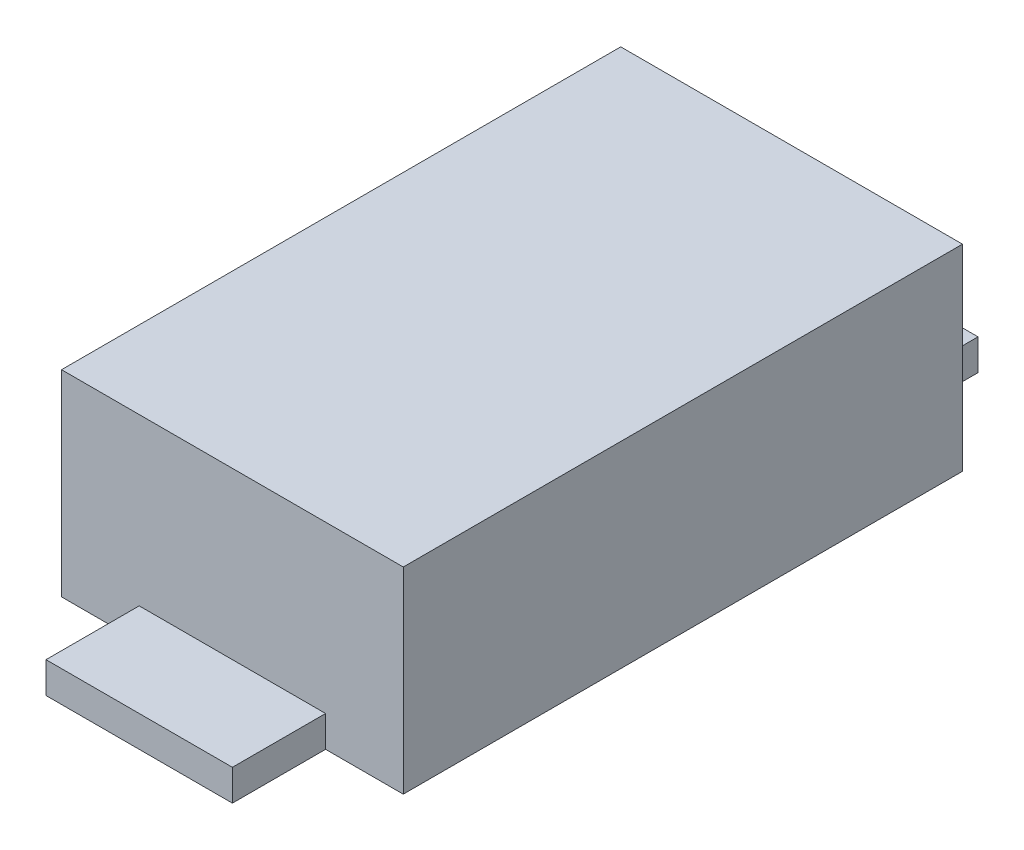
ISO-10303-21;
HEADER;
FILE_DESCRIPTION(('STEP AP214'),'2;1');
FILE_NAME('part.step','',(''),(''),'','','');
FILE_SCHEMA(('AUTOMOTIVE_DESIGN { 1 0 10303 214 1 1 1 1 }'));
ENDSEC;
DATA;
#1=APPLICATION_CONTEXT('core data for automotive mechanical design processes');
#2=APPLICATION_PROTOCOL_DEFINITION('international standard','automotive_design',2000,#1);
#3=PRODUCT_CONTEXT('',#1,'mechanical');
#4=PRODUCT('Part','Part','',(#3));
#5=PRODUCT_RELATED_PRODUCT_CATEGORY('part','',(#4));
#6=PRODUCT_DEFINITION_FORMATION('','',#4);
#7=PRODUCT_DEFINITION_CONTEXT('part definition',#1,'design');
#8=PRODUCT_DEFINITION('design','',#6,#7);
#9=PRODUCT_DEFINITION_SHAPE('','',#8);
#10=(LENGTH_UNIT() NAMED_UNIT(*) SI_UNIT(.MILLI.,.METRE.));
#11=(NAMED_UNIT(*) PLANE_ANGLE_UNIT() SI_UNIT($,.RADIAN.));
#12=(NAMED_UNIT(*) SI_UNIT($,.STERADIAN.) SOLID_ANGLE_UNIT());
#13=UNCERTAINTY_MEASURE_WITH_UNIT(LENGTH_MEASURE(1.E-05),#10,'distance_accuracy_value','');
#14=(GEOMETRIC_REPRESENTATION_CONTEXT(3) GLOBAL_UNCERTAINTY_ASSIGNED_CONTEXT((#13)) GLOBAL_UNIT_ASSIGNED_CONTEXT((#10,
#11,#12)) REPRESENTATION_CONTEXT('',''));
#15=CARTESIAN_POINT('',(0.,0.,0.));
#16=DIRECTION('',(0.,0.,1.));
#17=DIRECTION('',(1.,0.,0.));
#18=AXIS2_PLACEMENT_3D('',#15,#16,#17);
#19=CARTESIAN_POINT('',(-0.825,0.95,1.35));
#20=DIRECTION('',(0.,0.,-1.));
#21=DIRECTION('',(-1.,0.,0.));
#22=AXIS2_PLACEMENT_3D('',#19,#20,#21);
#23=PLANE('',#22);
#24=DIRECTION('',(0.,-1.,0.));
#25=VECTOR('',#24,1.);
#26=CARTESIAN_POINT('',(-0.45,0.15,1.35));
#27=LINE('',#26,#25);
#28=CARTESIAN_POINT('',(-0.45,0.15,1.35));
#29=VERTEX_POINT('',#28);
#30=CARTESIAN_POINT('',(-0.45,0.,1.35));
#31=VERTEX_POINT('',#30);
#32=EDGE_CURVE('E158',#29,#31,#27,.T.);
#33=ORIENTED_EDGE('',*,*,#32,.F.);
#34=DIRECTION('',(1.,0.,0.));
#35=VECTOR('',#34,1.);
#36=CARTESIAN_POINT('',(-0.45,0.15,1.35));
#37=LINE('',#36,#35);
#38=CARTESIAN_POINT('',(0.45,0.15,1.35));
#39=VERTEX_POINT('',#38);
#40=EDGE_CURVE('E149',#29,#39,#37,.T.);
#41=ORIENTED_EDGE('',*,*,#40,.T.);
#42=DIRECTION('',(0.,-1.,0.));
#43=VECTOR('',#42,1.);
#44=CARTESIAN_POINT('',(0.45,0.15,1.35));
#45=LINE('',#44,#43);
#46=CARTESIAN_POINT('',(0.45,0.,1.35));
#47=VERTEX_POINT('',#46);
#48=EDGE_CURVE('E164',#39,#47,#45,.T.);
#49=ORIENTED_EDGE('',*,*,#48,.T.);
#50=DIRECTION('',(1.,0.,0.));
#51=VECTOR('',#50,1.);
#52=CARTESIAN_POINT('',(-0.825,0.,1.35));
#53=LINE('',#52,#51);
#54=CARTESIAN_POINT('',(0.825,0.,1.35));
#55=VERTEX_POINT('',#54);
#56=EDGE_CURVE('E209',#47,#55,#53,.T.);
#57=ORIENTED_EDGE('',*,*,#56,.T.);
#58=DIRECTION('',(0.,-1.,0.));
#59=VECTOR('',#58,1.);
#60=CARTESIAN_POINT('',(0.825,0.95,1.35));
#61=LINE('',#60,#59);
#62=CARTESIAN_POINT('',(0.825,0.95,1.35));
#63=VERTEX_POINT('',#62);
#64=EDGE_CURVE('E200',#63,#55,#61,.T.);
#65=ORIENTED_EDGE('',*,*,#64,.F.);
#66=DIRECTION('',(1.,0.,0.));
#67=VECTOR('',#66,1.);
#68=CARTESIAN_POINT('',(-0.825,0.95,1.35));
#69=LINE('',#68,#67);
#70=CARTESIAN_POINT('',(-0.825,0.95,1.35));
#71=VERTEX_POINT('',#70);
#72=EDGE_CURVE('E198',#71,#63,#69,.T.);
#73=ORIENTED_EDGE('',*,*,#72,.F.);
#74=DIRECTION('',(0.,-1.,0.));
#75=VECTOR('',#74,1.);
#76=CARTESIAN_POINT('',(-0.825,0.95,1.35));
#77=LINE('',#76,#75);
#78=CARTESIAN_POINT('',(-0.825,0.,1.35));
#79=VERTEX_POINT('',#78);
#80=EDGE_CURVE('E214',#71,#79,#77,.T.);
#81=ORIENTED_EDGE('',*,*,#80,.T.);
#82=EDGE_CURVE('E194',#79,#31,#53,.T.);
#83=ORIENTED_EDGE('',*,*,#82,.T.);
#84=EDGE_LOOP('',(#33,#41,#49,#57,#65,#73,#81,#83));
#85=FACE_BOUND('',#84,.T.);
#86=ADVANCED_FACE('F39',(#85),#23,.F.);
#87=CARTESIAN_POINT('',(-0.825000000000001,0.95,-1.35));
#88=DIRECTION('',(0.,0.,1.));
#89=DIRECTION('',(1.,0.,0.));
#90=AXIS2_PLACEMENT_3D('',#87,#88,#89);
#91=PLANE('',#90);
#92=DIRECTION('',(0.,-1.,0.));
#93=VECTOR('',#92,1.);
#94=CARTESIAN_POINT('',(0.45,0.15,-1.35));
#95=LINE('',#94,#93);
#96=CARTESIAN_POINT('',(0.45,0.15,-1.35));
#97=VERTEX_POINT('',#96);
#98=CARTESIAN_POINT('',(0.45,0.,-1.35));
#99=VERTEX_POINT('',#98);
#100=EDGE_CURVE('E185',#97,#99,#95,.T.);
#101=ORIENTED_EDGE('',*,*,#100,.F.);
#102=DIRECTION('',(1.,0.,0.));
#103=VECTOR('',#102,1.);
#104=CARTESIAN_POINT('',(-0.45,0.15,-1.35));
#105=LINE('',#104,#103);
#106=CARTESIAN_POINT('',(-0.45,0.15,-1.35));
#107=VERTEX_POINT('',#106);
#108=EDGE_CURVE('E169',#107,#97,#105,.T.);
#109=ORIENTED_EDGE('',*,*,#108,.F.);
#110=DIRECTION('',(0.,-1.,0.));
#111=VECTOR('',#110,1.);
#112=CARTESIAN_POINT('',(-0.45,0.15,-1.35));
#113=LINE('',#112,#111);
#114=CARTESIAN_POINT('',(-0.45,0.,-1.35));
#115=VERTEX_POINT('',#114);
#116=EDGE_CURVE('E187',#107,#115,#113,.T.);
#117=ORIENTED_EDGE('',*,*,#116,.T.);
#118=DIRECTION('',(-1.,0.,0.));
#119=VECTOR('',#118,1.);
#120=CARTESIAN_POINT('',(-0.825000000000001,0.,-1.35));
#121=LINE('',#120,#119);
#122=CARTESIAN_POINT('',(-0.825000000000001,0.,-1.35));
#123=VERTEX_POINT('',#122);
#124=EDGE_CURVE('E203',#115,#123,#121,.T.);
#125=ORIENTED_EDGE('',*,*,#124,.T.);
#126=DIRECTION('',(0.,-1.,0.));
#127=VECTOR('',#126,1.);
#128=CARTESIAN_POINT('',(-0.825000000000001,0.95,-1.35));
#129=LINE('',#128,#127);
#130=CARTESIAN_POINT('',(-0.825000000000001,0.95,-1.35));
#131=VERTEX_POINT('',#130);
#132=EDGE_CURVE('E47',#131,#123,#129,.T.);
#133=ORIENTED_EDGE('',*,*,#132,.F.);
#134=DIRECTION('',(-1.,0.,0.));
#135=VECTOR('',#134,1.);
#136=CARTESIAN_POINT('',(-0.825000000000001,0.95,-1.35));
#137=LINE('',#136,#135);
#138=CARTESIAN_POINT('',(0.824999999999999,0.95,-1.35));
#139=VERTEX_POINT('',#138);
#140=EDGE_CURVE('E193',#139,#131,#137,.T.);
#141=ORIENTED_EDGE('',*,*,#140,.F.);
#142=DIRECTION('',(0.,-1.,0.));
#143=VECTOR('',#142,1.);
#144=CARTESIAN_POINT('',(0.824999999999999,0.95,-1.35));
#145=LINE('',#144,#143);
#146=CARTESIAN_POINT('',(0.824999999999999,0.,-1.35));
#147=VERTEX_POINT('',#146);
#148=EDGE_CURVE('E11',#139,#147,#145,.T.);
#149=ORIENTED_EDGE('',*,*,#148,.T.);
#150=EDGE_CURVE('E204',#147,#99,#121,.T.);
#151=ORIENTED_EDGE('',*,*,#150,.T.);
#152=EDGE_LOOP('',(#101,#109,#117,#125,#133,#141,#149,#151));
#153=FACE_BOUND('',#152,.T.);
#154=ADVANCED_FACE('F237',(#153),#91,.F.);
#155=CARTESIAN_POINT('',(0.824999999999999,0.95,-1.35));
#156=DIRECTION('',(-1.,0.,0.));
#157=DIRECTION('',(0.,0.,1.));
#158=AXIS2_PLACEMENT_3D('',#155,#156,#157);
#159=PLANE('',#158);
#160=DIRECTION('',(0.,0.,-1.));
#161=VECTOR('',#160,1.);
#162=CARTESIAN_POINT('',(0.824999999999999,0.,-1.35));
#163=LINE('',#162,#161);
#164=EDGE_CURVE('E189',#55,#147,#163,.T.);
#165=ORIENTED_EDGE('',*,*,#164,.T.);
#166=ORIENTED_EDGE('',*,*,#148,.F.);
#167=DIRECTION('',(0.,0.,-1.));
#168=VECTOR('',#167,1.);
#169=CARTESIAN_POINT('',(0.824999999999999,0.95,-1.35));
#170=LINE('',#169,#168);
#171=EDGE_CURVE('E190',#63,#139,#170,.T.);
#172=ORIENTED_EDGE('',*,*,#171,.F.);
#173=ORIENTED_EDGE('',*,*,#64,.T.);
#174=EDGE_LOOP('',(#165,#166,#172,#173));
#175=FACE_BOUND('',#174,.T.);
#176=ADVANCED_FACE('F41',(#175),#159,.F.);
#177=CARTESIAN_POINT('',(-0.825000000000001,0.95,-1.35));
#178=DIRECTION('',(1.,0.,0.));
#179=DIRECTION('',(0.,0.,-1.));
#180=AXIS2_PLACEMENT_3D('',#177,#178,#179);
#181=PLANE('',#180);
#182=DIRECTION('',(0.,0.,1.));
#183=VECTOR('',#182,1.);
#184=CARTESIAN_POINT('',(-0.825000000000001,0.,-1.35));
#185=LINE('',#184,#183);
#186=EDGE_CURVE('E207',#123,#79,#185,.T.);
#187=ORIENTED_EDGE('',*,*,#186,.T.);
#188=ORIENTED_EDGE('',*,*,#80,.F.);
#189=DIRECTION('',(0.,0.,1.));
#190=VECTOR('',#189,1.);
#191=CARTESIAN_POINT('',(-0.825000000000001,0.95,-1.35));
#192=LINE('',#191,#190);
#193=EDGE_CURVE('E196',#131,#71,#192,.T.);
#194=ORIENTED_EDGE('',*,*,#193,.F.);
#195=ORIENTED_EDGE('',*,*,#132,.T.);
#196=EDGE_LOOP('',(#187,#188,#194,#195));
#197=FACE_BOUND('',#196,.T.);
#198=ADVANCED_FACE('F221',(#197),#181,.F.);
#199=CARTESIAN_POINT('',(0.,0.95,0.));
#200=DIRECTION('',(0.,1.,0.));
#201=DIRECTION('',(0.,0.,1.));
#202=AXIS2_PLACEMENT_3D('',#199,#200,#201);
#203=PLANE('',#202);
#204=ORIENTED_EDGE('',*,*,#171,.T.);
#205=ORIENTED_EDGE('',*,*,#140,.T.);
#206=ORIENTED_EDGE('',*,*,#193,.T.);
#207=ORIENTED_EDGE('',*,*,#72,.T.);
#208=EDGE_LOOP('',(#204,#205,#206,#207));
#209=FACE_BOUND('',#208,.T.);
#210=ADVANCED_FACE('F234',(#209),#203,.T.);
#211=CARTESIAN_POINT('',(0.,0.,0.));
#212=DIRECTION('',(0.,1.,0.));
#213=DIRECTION('',(0.,0.,1.));
#214=AXIS2_PLACEMENT_3D('',#211,#212,#213);
#215=PLANE('',#214);
#216=ORIENTED_EDGE('',*,*,#164,.F.);
#217=ORIENTED_EDGE('',*,*,#56,.F.);
#218=DIRECTION('',(0.,0.,1.));
#219=VECTOR('',#218,1.);
#220=CARTESIAN_POINT('',(0.45,0.,1.35));
#221=LINE('',#220,#219);
#222=CARTESIAN_POINT('',(0.45,0.,1.8));
#223=VERTEX_POINT('',#222);
#224=EDGE_CURVE('E54',#47,#223,#221,.T.);
#225=ORIENTED_EDGE('',*,*,#224,.T.);
#226=DIRECTION('',(-1.,0.,0.));
#227=VECTOR('',#226,1.);
#228=CARTESIAN_POINT('',(-0.45,0.,1.8));
#229=LINE('',#228,#227);
#230=CARTESIAN_POINT('',(-0.45,0.,1.8));
#231=VERTEX_POINT('',#230);
#232=EDGE_CURVE('E160',#223,#231,#229,.T.);
#233=ORIENTED_EDGE('',*,*,#232,.T.);
#234=DIRECTION('',(0.,0.,-1.));
#235=VECTOR('',#234,1.);
#236=CARTESIAN_POINT('',(-0.45,0.,1.35));
#237=LINE('',#236,#235);
#238=EDGE_CURVE('E135',#231,#31,#237,.T.);
#239=ORIENTED_EDGE('',*,*,#238,.T.);
#240=ORIENTED_EDGE('',*,*,#82,.F.);
#241=ORIENTED_EDGE('',*,*,#186,.F.);
#242=ORIENTED_EDGE('',*,*,#124,.F.);
#243=DIRECTION('',(0.,0.,1.));
#244=VECTOR('',#243,1.);
#245=CARTESIAN_POINT('',(-0.45,0.,-1.35));
#246=LINE('',#245,#244);
#247=CARTESIAN_POINT('',(-0.45,0.,-1.8));
#248=VERTEX_POINT('',#247);
#249=EDGE_CURVE('E62',#248,#115,#246,.T.);
#250=ORIENTED_EDGE('',*,*,#249,.F.);
#251=DIRECTION('',(-1.,0.,0.));
#252=VECTOR('',#251,1.);
#253=CARTESIAN_POINT('',(-0.45,0.,-1.8));
#254=LINE('',#253,#252);
#255=CARTESIAN_POINT('',(0.45,0.,-1.8));
#256=VERTEX_POINT('',#255);
#257=EDGE_CURVE('E170',#256,#248,#254,.T.);
#258=ORIENTED_EDGE('',*,*,#257,.F.);
#259=DIRECTION('',(0.,0.,-1.));
#260=VECTOR('',#259,1.);
#261=CARTESIAN_POINT('',(0.45,0.,-1.35));
#262=LINE('',#261,#260);
#263=EDGE_CURVE('E178',#99,#256,#262,.T.);
#264=ORIENTED_EDGE('',*,*,#263,.F.);
#265=ORIENTED_EDGE('',*,*,#150,.F.);
#266=EDGE_LOOP('',(#216,#217,#225,#233,#239,#240,#241,#242,#250,#258,#264,#265));
#267=FACE_BOUND('',#266,.T.);
#268=ADVANCED_FACE('F228',(#267),#215,.F.);
#269=CARTESIAN_POINT('',(-0.45,0.15,-1.35));
#270=DIRECTION('',(1.,0.,0.));
#271=DIRECTION('',(0.,0.,-1.));
#272=AXIS2_PLACEMENT_3D('',#269,#270,#271);
#273=PLANE('',#272);
#274=ORIENTED_EDGE('',*,*,#249,.T.);
#275=ORIENTED_EDGE('',*,*,#116,.F.);
#276=DIRECTION('',(0.,0.,1.));
#277=VECTOR('',#276,1.);
#278=CARTESIAN_POINT('',(-0.45,0.15,-1.35));
#279=LINE('',#278,#277);
#280=CARTESIAN_POINT('',(-0.45,0.15,-1.8));
#281=VERTEX_POINT('',#280);
#282=EDGE_CURVE('E167',#281,#107,#279,.T.);
#283=ORIENTED_EDGE('',*,*,#282,.F.);
#284=DIRECTION('',(0.,-1.,0.));
#285=VECTOR('',#284,1.);
#286=CARTESIAN_POINT('',(-0.45,0.15,-1.8));
#287=LINE('',#286,#285);
#288=EDGE_CURVE('E176',#281,#248,#287,.T.);
#289=ORIENTED_EDGE('',*,*,#288,.T.);
#290=EDGE_LOOP('',(#274,#275,#283,#289));
#291=FACE_BOUND('',#290,.T.);
#292=ADVANCED_FACE('F254',(#291),#273,.F.);
#293=CARTESIAN_POINT('',(0.45,0.15,-1.35));
#294=DIRECTION('',(-1.,0.,0.));
#295=DIRECTION('',(0.,0.,1.));
#296=AXIS2_PLACEMENT_3D('',#293,#294,#295);
#297=PLANE('',#296);
#298=ORIENTED_EDGE('',*,*,#263,.T.);
#299=DIRECTION('',(0.,-1.,0.));
#300=VECTOR('',#299,1.);
#301=CARTESIAN_POINT('',(0.45,0.15,-1.8));
#302=LINE('',#301,#300);
#303=CARTESIAN_POINT('',(0.45,0.15,-1.8));
#304=VERTEX_POINT('',#303);
#305=EDGE_CURVE('E182',#304,#256,#302,.T.);
#306=ORIENTED_EDGE('',*,*,#305,.F.);
#307=DIRECTION('',(0.,0.,-1.));
#308=VECTOR('',#307,1.);
#309=CARTESIAN_POINT('',(0.45,0.15,-1.35));
#310=LINE('',#309,#308);
#311=EDGE_CURVE('E172',#97,#304,#310,.T.);
#312=ORIENTED_EDGE('',*,*,#311,.F.);
#313=ORIENTED_EDGE('',*,*,#100,.T.);
#314=EDGE_LOOP('',(#298,#306,#312,#313));
#315=FACE_BOUND('',#314,.T.);
#316=ADVANCED_FACE('F244',(#315),#297,.F.);
#317=CARTESIAN_POINT('',(-0.45,0.15,-1.8));
#318=DIRECTION('',(0.,0.,1.));
#319=DIRECTION('',(1.,0.,0.));
#320=AXIS2_PLACEMENT_3D('',#317,#318,#319);
#321=PLANE('',#320);
#322=ORIENTED_EDGE('',*,*,#257,.T.);
#323=ORIENTED_EDGE('',*,*,#288,.F.);
#324=DIRECTION('',(-1.,0.,0.));
#325=VECTOR('',#324,1.);
#326=CARTESIAN_POINT('',(-0.45,0.15,-1.8));
#327=LINE('',#326,#325);
#328=EDGE_CURVE('E174',#304,#281,#327,.T.);
#329=ORIENTED_EDGE('',*,*,#328,.F.);
#330=ORIENTED_EDGE('',*,*,#305,.T.);
#331=EDGE_LOOP('',(#322,#323,#329,#330));
#332=FACE_BOUND('',#331,.T.);
#333=ADVANCED_FACE('F248',(#332),#321,.F.);
#334=CARTESIAN_POINT('',(0.,0.15,0.));
#335=DIRECTION('',(0.,-1.,0.));
#336=DIRECTION('',(0.,0.,-1.));
#337=AXIS2_PLACEMENT_3D('',#334,#335,#336);
#338=PLANE('',#337);
#339=ORIENTED_EDGE('',*,*,#282,.T.);
#340=ORIENTED_EDGE('',*,*,#108,.T.);
#341=ORIENTED_EDGE('',*,*,#311,.T.);
#342=ORIENTED_EDGE('',*,*,#328,.T.);
#343=EDGE_LOOP('',(#339,#340,#341,#342));
#344=FACE_BOUND('',#343,.T.);
#345=ADVANCED_FACE('F252',(#344),#338,.F.);
#346=CARTESIAN_POINT('',(-0.45,0.15,1.35));
#347=DIRECTION('',(-1.,0.,0.));
#348=DIRECTION('',(0.,0.,1.));
#349=AXIS2_PLACEMENT_3D('',#346,#347,#348);
#350=PLANE('',#349);
#351=ORIENTED_EDGE('',*,*,#238,.F.);
#352=DIRECTION('',(0.,-1.,0.));
#353=VECTOR('',#352,1.);
#354=CARTESIAN_POINT('',(-0.45,0.15,1.8));
#355=LINE('',#354,#353);
#356=CARTESIAN_POINT('',(-0.45,0.15,1.8));
#357=VERTEX_POINT('',#356);
#358=EDGE_CURVE('E129',#357,#231,#355,.T.);
#359=ORIENTED_EDGE('',*,*,#358,.F.);
#360=DIRECTION('',(0.,0.,-1.));
#361=VECTOR('',#360,1.);
#362=CARTESIAN_POINT('',(-0.45,0.15,1.35));
#363=LINE('',#362,#361);
#364=EDGE_CURVE('E132',#357,#29,#363,.T.);
#365=ORIENTED_EDGE('',*,*,#364,.T.);
#366=ORIENTED_EDGE('',*,*,#32,.T.);
#367=EDGE_LOOP('',(#351,#359,#365,#366));
#368=FACE_BOUND('',#367,.T.);
#369=ADVANCED_FACE('F131',(#368),#350,.T.);
#370=CARTESIAN_POINT('',(-0.45,0.15,1.8));
#371=DIRECTION('',(0.,0.,1.));
#372=DIRECTION('',(1.,0.,0.));
#373=AXIS2_PLACEMENT_3D('',#370,#371,#372);
#374=PLANE('',#373);
#375=ORIENTED_EDGE('',*,*,#232,.F.);
#376=DIRECTION('',(0.,-1.,0.));
#377=VECTOR('',#376,1.);
#378=CARTESIAN_POINT('',(0.45,0.15,1.8));
#379=LINE('',#378,#377);
#380=CARTESIAN_POINT('',(0.45,0.15,1.8));
#381=VERTEX_POINT('',#380);
#382=EDGE_CURVE('E140',#381,#223,#379,.T.);
#383=ORIENTED_EDGE('',*,*,#382,.F.);
#384=DIRECTION('',(-1.,0.,0.));
#385=VECTOR('',#384,1.);
#386=CARTESIAN_POINT('',(-0.45,0.15,1.8));
#387=LINE('',#386,#385);
#388=EDGE_CURVE('E146',#381,#357,#387,.T.);
#389=ORIENTED_EDGE('',*,*,#388,.T.);
#390=ORIENTED_EDGE('',*,*,#358,.T.);
#391=EDGE_LOOP('',(#375,#383,#389,#390));
#392=FACE_BOUND('',#391,.T.);
#393=ADVANCED_FACE('F152',(#392),#374,.T.);
#394=CARTESIAN_POINT('',(0.45,0.15,1.35));
#395=DIRECTION('',(1.,0.,0.));
#396=DIRECTION('',(0.,0.,-1.));
#397=AXIS2_PLACEMENT_3D('',#394,#395,#396);
#398=PLANE('',#397);
#399=ORIENTED_EDGE('',*,*,#224,.F.);
#400=ORIENTED_EDGE('',*,*,#48,.F.);
#401=DIRECTION('',(0.,0.,1.));
#402=VECTOR('',#401,1.);
#403=CARTESIAN_POINT('',(0.45,0.15,1.35));
#404=LINE('',#403,#402);
#405=EDGE_CURVE('E153',#39,#381,#404,.T.);
#406=ORIENTED_EDGE('',*,*,#405,.T.);
#407=ORIENTED_EDGE('',*,*,#382,.T.);
#408=EDGE_LOOP('',(#399,#400,#406,#407));
#409=FACE_BOUND('',#408,.T.);
#410=ADVANCED_FACE('F320',(#409),#398,.T.);
#411=CARTESIAN_POINT('',(0.,0.15,0.));
#412=DIRECTION('',(0.,-1.,0.));
#413=DIRECTION('',(0.,0.,1.));
#414=AXIS2_PLACEMENT_3D('',#411,#412,#413);
#415=PLANE('',#414);
#416=ORIENTED_EDGE('',*,*,#364,.F.);
#417=ORIENTED_EDGE('',*,*,#388,.F.);
#418=ORIENTED_EDGE('',*,*,#405,.F.);
#419=ORIENTED_EDGE('',*,*,#40,.F.);
#420=EDGE_LOOP('',(#416,#417,#418,#419));
#421=FACE_BOUND('',#420,.T.);
#422=ADVANCED_FACE('F144',(#421),#415,.F.);
#423=CLOSED_SHELL('',(#86,#154,#176,#198,#210,#268,#292,#316,#333,#345,#369,#393,#410,#422));
#424=MANIFOLD_SOLID_BREP('B2',#423);
#425=ADVANCED_BREP_SHAPE_REPRESENTATION('',(#18,#424),#14);
#426=SHAPE_DEFINITION_REPRESENTATION(#9,#425);
ENDSEC;
END-ISO-10303-21;
